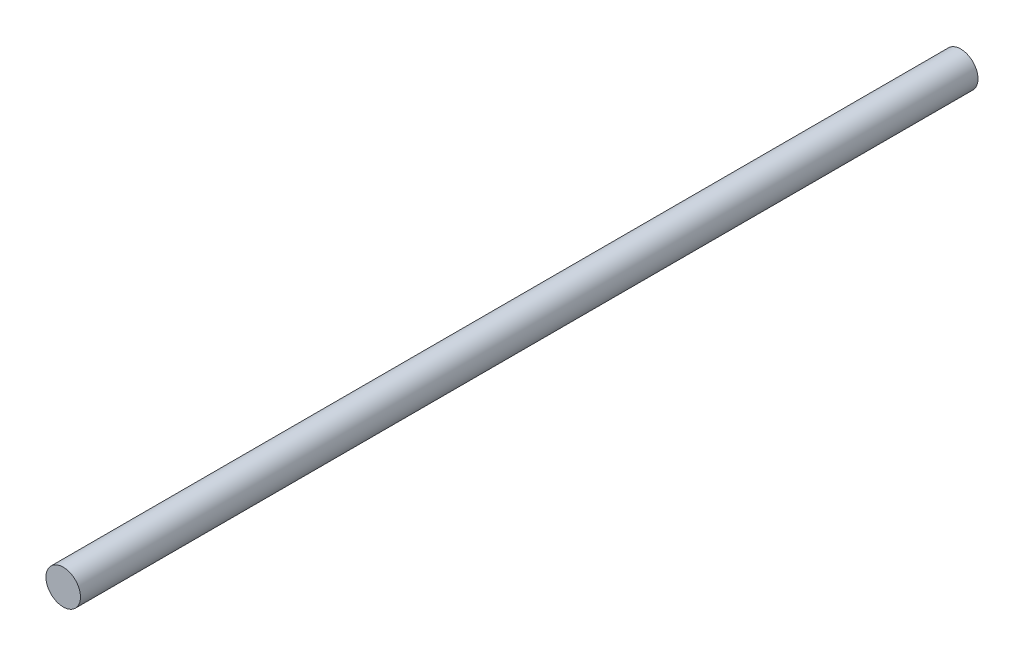
ISO-10303-21;
HEADER;
FILE_DESCRIPTION(('STEP AP214'),'2;1');
FILE_NAME('part.step','',(''),(''),'','','');
FILE_SCHEMA(('AUTOMOTIVE_DESIGN { 1 0 10303 214 1 1 1 1 }'));
ENDSEC;
DATA;
#1=APPLICATION_CONTEXT('core data for automotive mechanical design processes');
#2=APPLICATION_PROTOCOL_DEFINITION('international standard','automotive_design',2000,#1);
#3=PRODUCT_CONTEXT('',#1,'mechanical');
#4=PRODUCT('Part','Part','',(#3));
#5=PRODUCT_RELATED_PRODUCT_CATEGORY('part','',(#4));
#6=PRODUCT_DEFINITION_FORMATION('','',#4);
#7=PRODUCT_DEFINITION_CONTEXT('part definition',#1,'design');
#8=PRODUCT_DEFINITION('design','',#6,#7);
#9=PRODUCT_DEFINITION_SHAPE('','',#8);
#10=(LENGTH_UNIT() NAMED_UNIT(*) SI_UNIT(.MILLI.,.METRE.));
#11=(NAMED_UNIT(*) PLANE_ANGLE_UNIT() SI_UNIT($,.RADIAN.));
#12=(NAMED_UNIT(*) SI_UNIT($,.STERADIAN.) SOLID_ANGLE_UNIT());
#13=UNCERTAINTY_MEASURE_WITH_UNIT(LENGTH_MEASURE(1.E-05),#10,'distance_accuracy_value','');
#14=(GEOMETRIC_REPRESENTATION_CONTEXT(3) GLOBAL_UNCERTAINTY_ASSIGNED_CONTEXT((#13)) GLOBAL_UNIT_ASSIGNED_CONTEXT((#10,
#11,#12)) REPRESENTATION_CONTEXT('',''));
#15=CARTESIAN_POINT('',(0.,0.,0.));
#16=DIRECTION('',(0.,0.,1.));
#17=DIRECTION('',(1.,0.,0.));
#18=AXIS2_PLACEMENT_3D('',#15,#16,#17);
#19=CARTESIAN_POINT('',(0.,0.,104.));
#20=DIRECTION('',(0.,0.,-1.));
#21=DIRECTION('',(-1.,0.,0.));
#22=AXIS2_PLACEMENT_3D('',#19,#20,#21);
#23=CYLINDRICAL_SURFACE('',#22,2.);
#24=CARTESIAN_POINT('',(0.,0.,104.));
#25=DIRECTION('',(0.,0.,1.));
#26=DIRECTION('',(1.,0.,0.));
#27=AXIS2_PLACEMENT_3D('',#24,#25,#26);
#28=CIRCLE('',#27,2.);
#29=CARTESIAN_POINT('',(2.,0.,104.));
#30=VERTEX_POINT('',#29);
#31=EDGE_CURVE('E10',#30,#30,#28,.T.);
#32=ORIENTED_EDGE('',*,*,#31,.F.);
#33=EDGE_LOOP('',(#32));
#34=FACE_BOUND('',#33,.T.);
#35=CARTESIAN_POINT('',(0.,0.,0.));
#36=DIRECTION('',(0.,0.,1.));
#37=DIRECTION('',(1.,0.,0.));
#38=AXIS2_PLACEMENT_3D('',#35,#36,#37);
#39=CIRCLE('',#38,2.);
#40=CARTESIAN_POINT('',(2.,0.,0.));
#41=VERTEX_POINT('',#40);
#42=EDGE_CURVE('E38',#41,#41,#39,.T.);
#43=ORIENTED_EDGE('',*,*,#42,.T.);
#44=EDGE_LOOP('',(#43));
#45=FACE_BOUND('',#44,.T.);
#46=ADVANCED_FACE('F35',(#34,#45),#23,.T.);
#47=CARTESIAN_POINT('',(0.,0.,104.));
#48=DIRECTION('',(0.,0.,1.));
#49=DIRECTION('',(1.,0.,0.));
#50=AXIS2_PLACEMENT_3D('',#47,#48,#49);
#51=PLANE('',#50);
#52=ORIENTED_EDGE('',*,*,#31,.T.);
#53=EDGE_LOOP('',(#52));
#54=FACE_BOUND('',#53,.T.);
#55=ADVANCED_FACE('F51',(#54),#51,.T.);
#56=CARTESIAN_POINT('',(0.,0.,0.));
#57=DIRECTION('',(0.,0.,1.));
#58=DIRECTION('',(1.,0.,0.));
#59=AXIS2_PLACEMENT_3D('',#56,#57,#58);
#60=PLANE('',#59);
#61=ORIENTED_EDGE('',*,*,#42,.F.);
#62=EDGE_LOOP('',(#61));
#63=FACE_BOUND('',#62,.T.);
#64=ADVANCED_FACE('F49',(#63),#60,.F.);
#65=CLOSED_SHELL('',(#46,#55,#64));
#66=MANIFOLD_SOLID_BREP('B2',#65);
#67=ADVANCED_BREP_SHAPE_REPRESENTATION('',(#18,#66),#14);
#68=SHAPE_DEFINITION_REPRESENTATION(#9,#67);
ENDSEC;
END-ISO-10303-21;
